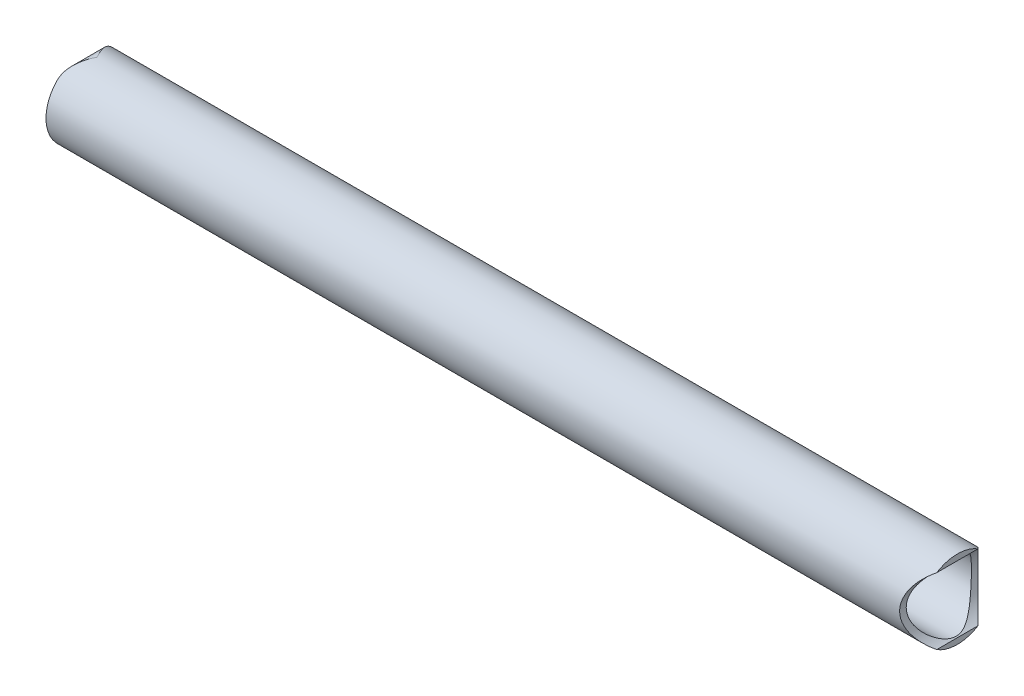
ISO-10303-21;
HEADER;
FILE_DESCRIPTION(('STEP AP214'),'2;1');
FILE_NAME('part.step','',(''),(''),'','','');
FILE_SCHEMA(('AUTOMOTIVE_DESIGN { 1 0 10303 214 1 1 1 1 }'));
ENDSEC;
DATA;
#1=APPLICATION_CONTEXT('core data for automotive mechanical design processes');
#2=APPLICATION_PROTOCOL_DEFINITION('international standard','automotive_design',2000,#1);
#3=PRODUCT_CONTEXT('',#1,'mechanical');
#4=PRODUCT('Part','Part','',(#3));
#5=PRODUCT_RELATED_PRODUCT_CATEGORY('part','',(#4));
#6=PRODUCT_DEFINITION_FORMATION('','',#4);
#7=PRODUCT_DEFINITION_CONTEXT('part definition',#1,'design');
#8=PRODUCT_DEFINITION('design','',#6,#7);
#9=PRODUCT_DEFINITION_SHAPE('','',#8);
#10=(LENGTH_UNIT() NAMED_UNIT(*) SI_UNIT(.MILLI.,.METRE.));
#11=(NAMED_UNIT(*) PLANE_ANGLE_UNIT() SI_UNIT($,.RADIAN.));
#12=(NAMED_UNIT(*) SI_UNIT($,.STERADIAN.) SOLID_ANGLE_UNIT());
#13=UNCERTAINTY_MEASURE_WITH_UNIT(LENGTH_MEASURE(1.E-05),#10,'distance_accuracy_value','');
#14=(GEOMETRIC_REPRESENTATION_CONTEXT(3) GLOBAL_UNCERTAINTY_ASSIGNED_CONTEXT((#13)) GLOBAL_UNIT_ASSIGNED_CONTEXT((#10,
#11,#12)) REPRESENTATION_CONTEXT('',''));
#15=CARTESIAN_POINT('',(0.,0.,0.));
#16=DIRECTION('',(0.,0.,1.));
#17=DIRECTION('',(1.,0.,0.));
#18=AXIS2_PLACEMENT_3D('',#15,#16,#17);
#19=CARTESIAN_POINT('',(469.10625,0.,0.));
#20=DIRECTION('',(1.,0.,0.));
#21=DIRECTION('',(0.,0.,-1.));
#22=AXIS2_PLACEMENT_3D('',#19,#20,#21);
#23=PLANE('',#22);
#24=DIRECTION('',(0.,0.,1.));
#25=VECTOR('',#24,1.);
#26=CARTESIAN_POINT('',(469.10625,17.9154421589309,-21.082));
#27=LINE('',#26,#25);
#28=CARTESIAN_POINT('',(469.10625,17.9154421589309,-11.1125));
#29=VERTEX_POINT('',#28);
#30=CARTESIAN_POINT('',(469.10625,17.915442158931,11.1125));
#31=VERTEX_POINT('',#30);
#32=EDGE_CURVE('E88',#29,#31,#27,.T.);
#33=ORIENTED_EDGE('',*,*,#32,.F.);
#34=CARTESIAN_POINT('',(469.10625,0.,0.));
#35=DIRECTION('',(1.,0.,0.));
#36=DIRECTION('',(0.,0.,-1.));
#37=AXIS2_PLACEMENT_3D('',#34,#35,#36);
#38=CIRCLE('',#37,21.082);
#39=EDGE_CURVE('E48',#29,#31,#38,.T.);
#40=ORIENTED_EDGE('',*,*,#39,.T.);
#41=EDGE_LOOP('',(#33,#40));
#42=FACE_BOUND('',#41,.T.);
#43=ADVANCED_FACE('F33',(#42),#23,.T.);
#44=DIRECTION('',(0.,0.,1.));
#45=VECTOR('',#44,1.);
#46=CARTESIAN_POINT('',(469.10625,-17.9154421589309,-21.082));
#47=LINE('',#46,#45);
#48=CARTESIAN_POINT('',(469.10625,-17.915442158931,11.1125));
#49=VERTEX_POINT('',#48);
#50=CARTESIAN_POINT('',(469.10625,-17.9154421589309,-11.1125));
#51=VERTEX_POINT('',#50);
#52=EDGE_CURVE('E85',#49,#51,#47,.F.);
#53=ORIENTED_EDGE('',*,*,#52,.F.);
#54=EDGE_CURVE('E93',#49,#51,#38,.T.);
#55=ORIENTED_EDGE('',*,*,#54,.T.);
#56=EDGE_LOOP('',(#53,#55));
#57=FACE_BOUND('',#56,.T.);
#58=ADVANCED_FACE('F92',(#57),#23,.T.);
#59=CARTESIAN_POINT('',(0.,0.,0.));
#60=DIRECTION('',(1.,0.,0.));
#61=DIRECTION('',(0.,0.,-1.));
#62=AXIS2_PLACEMENT_3D('',#59,#60,#61);
#63=PLANE('',#62);
#64=CARTESIAN_POINT('',(0.,0.,0.));
#65=DIRECTION('',(1.,0.,0.));
#66=DIRECTION('',(0.,0.,-1.));
#67=AXIS2_PLACEMENT_3D('',#64,#65,#66);
#68=CIRCLE('',#67,21.082);
#69=CARTESIAN_POINT('',(0.,14.732,15.0804144505382));
#70=VERTEX_POINT('',#69);
#71=CARTESIAN_POINT('',(0.,14.732,-15.0804144505382));
#72=VERTEX_POINT('',#71);
#73=EDGE_CURVE('E96',#70,#72,#68,.T.);
#74=ORIENTED_EDGE('',*,*,#73,.F.);
#75=DIRECTION('',(0.,0.,1.));
#76=VECTOR('',#75,1.);
#77=CARTESIAN_POINT('',(0.,14.732,-21.082));
#78=LINE('',#77,#76);
#79=CARTESIAN_POINT('',(0.,14.732,9.49362164824362));
#80=VERTEX_POINT('',#79);
#81=EDGE_CURVE('E126',#80,#70,#78,.T.);
#82=ORIENTED_EDGE('',*,*,#81,.F.);
#83=CARTESIAN_POINT('',(0.,0.,0.));
#84=DIRECTION('',(1.,0.,0.));
#85=DIRECTION('',(0.,0.,-1.));
#86=AXIS2_PLACEMENT_3D('',#83,#84,#85);
#87=CIRCLE('',#86,17.526);
#88=CARTESIAN_POINT('',(0.,14.732,-9.49362164824362));
#89=VERTEX_POINT('',#88);
#90=EDGE_CURVE('E99',#80,#89,#87,.T.);
#91=ORIENTED_EDGE('',*,*,#90,.T.);
#92=EDGE_CURVE('E62',#72,#89,#78,.T.);
#93=ORIENTED_EDGE('',*,*,#92,.F.);
#94=EDGE_LOOP('',(#74,#82,#91,#93));
#95=FACE_BOUND('',#94,.T.);
#96=ADVANCED_FACE('F139',(#95),#63,.F.);
#97=CARTESIAN_POINT('',(469.10625,0.,0.));
#98=DIRECTION('',(-1.,0.,0.));
#99=DIRECTION('',(0.,0.,1.));
#100=AXIS2_PLACEMENT_3D('',#97,#98,#99);
#101=CYLINDRICAL_SURFACE('',#100,21.082);
#102=ORIENTED_EDGE('',*,*,#73,.T.);
#103=CARTESIAN_POINT('',(0.,14.732,-15.0804144505382));
#104=CARTESIAN_POINT('',(4.99777097256306E-06,14.8585166363932,-14.9568250218965));
#105=CARTESIAN_POINT('',(0.0037804024379681,14.9834433145249,-14.8316684363902));
#106=CARTESIAN_POINT('',(0.018344612519162,15.2298802862784,-14.578499414352));
#107=CARTESIAN_POINT('',(0.0291313987626797,15.3513915529794,-14.4504878102679));
#108=CARTESIAN_POINT('',(0.0711641868780703,15.7100653220193,-14.0630095037458));
#109=CARTESIAN_POINT('',(0.112087001365868,15.9418874425845,-13.7995912481011));
#110=CARTESIAN_POINT('',(0.215488507432889,16.3879660671565,-13.2666880799684));
#111=CARTESIAN_POINT('',(0.277765297706076,16.6023646270495,-12.997281336883));
#112=CARTESIAN_POINT('',(0.420807437337394,17.0156387002352,-12.4513482602452));
#113=CARTESIAN_POINT('',(0.501584818248204,17.2145039983668,-12.1748173979638));
#114=CARTESIAN_POINT('',(0.722336490267377,17.6901137279932,-11.4788940830607));
#115=CARTESIAN_POINT('',(0.871915178025879,17.9572278098856,-11.0559422302578));
#116=CARTESIAN_POINT('',(1.19848542775072,18.4567086453977,-10.2003069203716));
#117=CARTESIAN_POINT('',(1.37548494857253,18.6890652721093,-9.76762066916));
#118=CARTESIAN_POINT('',(1.75209895067343,19.1211226362083,-8.89229878891464));
#119=CARTESIAN_POINT('',(1.9518397925665,19.3206241773796,-8.4496197349844));
#120=CARTESIAN_POINT('',(2.36824696498252,19.6862817768882,-7.55863388229215));
#121=CARTESIAN_POINT('',(2.58491234738668,19.8524397012882,-7.11032739995988));
#122=CARTESIAN_POINT('',(3.07854021979459,20.1841782782303,-6.11397748165988));
#123=CARTESIAN_POINT('',(3.35855407719812,20.3421826858222,-5.56492077807607));
#124=CARTESIAN_POINT('',(3.93195657278609,20.6121360645314,-4.46237555433802));
#125=CARTESIAN_POINT('',(4.2253492325938,20.7240710846151,-3.90888574337448));
#126=CARTESIAN_POINT('',(4.81966564824809,20.9026212412311,-2.80091191808466));
#127=CARTESIAN_POINT('',(5.12056407013035,20.9693718110366,-2.24643591433334));
#128=CARTESIAN_POINT('',(5.7263441140806,21.0587059818151,-1.13639917411688));
#129=CARTESIAN_POINT('',(6.0312234277849,21.0813141259917,-0.580839212441869));
#130=CARTESIAN_POINT('',(6.34068566822062,21.0819948744209,-0.0169715207830517));
#131=CARTESIAN_POINT('',(6.34534284661023,21.081999997751,-0.00848573804402203));
#132=CARTESIAN_POINT('',(6.35,21.082,0.));
#133=B_SPLINE_CURVE_WITH_KNOTS('',3,(#103,#104,#105,#106,#107,#108,#109,#110,#111,#112,#113,
#114,#115,#116,#117,#118,#119,#120,#121,#122,#123,#124,#125,#126,#127,#128,#129,#130,#131,#132),
.UNSPECIFIED.,.F.,.F.,(4,2,2,2,2,2,2,2,2,2,2,2,2,2,4),(0.,0.530465682198346,1.06077866603508,
2.11923257632368,3.16794284977036,4.21733708093636,5.78132496799527,7.34576765361523,
8.91937150261676,10.4928872609037,12.3996794344843,14.3070486112538,16.2086751300639,
18.1092440424708,18.1382833302831),.UNSPECIFIED.);
#134=CARTESIAN_POINT('',(6.35,21.082,0.));
#135=VERTEX_POINT('',#134);
#136=EDGE_CURVE('E125',#72,#135,#133,.T.);
#137=ORIENTED_EDGE('',*,*,#136,.T.);
#138=CARTESIAN_POINT('',(0.,14.732,15.0804144505382));
#139=CARTESIAN_POINT('',(4.99777097265902E-06,14.8585166363932,14.9568250218965));
#140=CARTESIAN_POINT('',(0.00378040243796859,14.983443314525,14.8316684363902));
#141=CARTESIAN_POINT('',(0.0183446125191639,15.2298802862785,14.5784994143519));
#142=CARTESIAN_POINT('',(0.0291313987626825,15.3513915529794,14.4504878102678));
#143=CARTESIAN_POINT('',(0.071164186878077,15.7100653220194,14.0630095037458));
#144=CARTESIAN_POINT('',(0.112087001365878,15.9418874425845,13.799591248101));
#145=CARTESIAN_POINT('',(0.215488507432905,16.3879660671565,13.2666880799683));
#146=CARTESIAN_POINT('',(0.277765297706091,16.6023646270495,12.9972813368829));
#147=CARTESIAN_POINT('',(0.420807437337405,17.0156387002352,12.4513482602451));
#148=CARTESIAN_POINT('',(0.501584818248212,17.2145039983668,12.1748173979638));
#149=CARTESIAN_POINT('',(0.722336490267378,17.6901137279932,11.4788940830607));
#150=CARTESIAN_POINT('',(0.871915178025876,17.9572278098856,11.0559422302578));
#151=CARTESIAN_POINT('',(1.19848542775071,18.4567086453976,10.2003069203717));
#152=CARTESIAN_POINT('',(1.37548494857251,18.6890652721093,9.76762066916005));
#153=CARTESIAN_POINT('',(1.75209895067341,19.1211226362082,8.89229878891469));
#154=CARTESIAN_POINT('',(1.95183979256649,19.3206241773795,8.44961973498444));
#155=CARTESIAN_POINT('',(2.36824696498251,19.6862817768881,7.55863388229216));
#156=CARTESIAN_POINT('',(2.58491234738667,19.8524397012882,7.11032739995988));
#157=CARTESIAN_POINT('',(3.0785402197946,20.1841782782303,6.11397748165988));
#158=CARTESIAN_POINT('',(3.35855407719814,20.3421826858222,5.56492077807609));
#159=CARTESIAN_POINT('',(3.93195657278606,20.6121360645314,4.462375554338));
#160=CARTESIAN_POINT('',(4.22534923259369,20.7240710846151,3.90888574337441));
#161=CARTESIAN_POINT('',(4.81966564824822,20.9026212412311,2.80091191808473));
#162=CARTESIAN_POINT('',(5.12056407013078,20.9693718110366,2.24643591433359));
#163=CARTESIAN_POINT('',(5.72634411408013,21.0587059818151,1.13639917411665));
#164=CARTESIAN_POINT('',(6.03122342778322,21.0813141259917,0.580839212440988));
#165=CARTESIAN_POINT('',(6.34068566822056,21.0819948744209,0.0169715207830728));
#166=CARTESIAN_POINT('',(6.3453428466102,21.081999997751,0.00848573804405541));
#167=CARTESIAN_POINT('',(6.35,21.082,0.));
#168=B_SPLINE_CURVE_WITH_KNOTS('',3,(#138,#139,#140,#141,#142,#143,#144,#145,#146,#147,#148,
#149,#150,#151,#152,#153,#154,#155,#156,#157,#158,#159,#160,#161,#162,#163,#164,#165,#166,#167),
.UNSPECIFIED.,.F.,.F.,(4,2,2,2,2,2,2,2,2,2,2,2,2,2,4),(0.,0.530465682198373,1.06077866603513,
2.11923257632378,3.16794284977042,4.21733708093637,5.78132496799524,7.34576765361516,
8.91937150261673,10.4928872609037,12.3996794344843,14.3070486112539,16.2086751300639,
18.1092440424708,18.1382833302831),.UNSPECIFIED.);
#169=EDGE_CURVE('E118',#135,#70,#168,.F.);
#170=ORIENTED_EDGE('',*,*,#169,.T.);
#171=EDGE_LOOP('',(#102,#137,#170));
#172=FACE_BOUND('',#171,.T.);
#173=ORIENTED_EDGE('',*,*,#39,.F.);
#174=CARTESIAN_POINT('',(480.21875,0.,0.));
#175=DIRECTION('',(-0.707106781186548,0.,0.707106781186547));
#176=DIRECTION('',(-0.707106781186548,0.,-0.707106781186547));
#177=AXIS2_PLACEMENT_3D('',#174,#175,#176);
#178=ELLIPSE('',#177,29.8144503219496,21.082);
#179=EDGE_CURVE('E95',#29,#51,#178,.T.);
#180=ORIENTED_EDGE('',*,*,#179,.T.);
#181=ORIENTED_EDGE('',*,*,#54,.F.);
#182=CARTESIAN_POINT('',(480.21875,0.,0.));
#183=DIRECTION('',(-0.707106781186548,0.,-0.707106781186547));
#184=DIRECTION('',(-0.707106781186548,0.,0.707106781186547));
#185=AXIS2_PLACEMENT_3D('',#182,#183,#184);
#186=ELLIPSE('',#185,29.8144503219496,21.082);
#187=EDGE_CURVE('E55',#49,#31,#186,.T.);
#188=ORIENTED_EDGE('',*,*,#187,.T.);
#189=EDGE_LOOP('',(#173,#180,#181,#188));
#190=FACE_BOUND('',#189,.T.);
#191=ADVANCED_FACE('F35',(#172,#190),#101,.T.);
#192=CARTESIAN_POINT('',(469.10625,0.,0.));
#193=DIRECTION('',(-1.,0.,0.));
#194=DIRECTION('',(0.,0.,1.));
#195=AXIS2_PLACEMENT_3D('',#192,#193,#194);
#196=CYLINDRICAL_SURFACE('',#195,17.526);
#197=CARTESIAN_POINT('',(459.13675,0.,17.526));
#198=CARTESIAN_POINT('',(459.136753100232,0.416555730228906,17.525996813955));
#199=CARTESIAN_POINT('',(459.149123313981,0.833163012071545,17.5111221446535));
#200=CARTESIAN_POINT('',(459.198320724751,1.66285085098589,17.4518957288154));
#201=CARTESIAN_POINT('',(459.235152005793,2.0759308074684,17.4075390599622));
#202=CARTESIAN_POINT('',(459.332452439066,2.89546158233793,17.2901260170745));
#203=CARTESIAN_POINT('',(459.392938843433,3.30190733638105,17.2170486963236));
#204=CARTESIAN_POINT('',(459.536212942405,4.10484124386305,17.0434647188049));
#205=CARTESIAN_POINT('',(459.619000210819,4.50132958743919,16.9429585862272));
#206=CARTESIAN_POINT('',(459.804608337995,5.27944797465432,16.7167963170662));
#207=CARTESIAN_POINT('',(459.907303655403,5.66115402240748,16.5912976561353));
#208=CARTESIAN_POINT('',(460.13114125938,6.41026860382347,16.3165047587702));
#209=CARTESIAN_POINT('',(460.252283245215,6.77767737045173,16.1672109102661));
#210=CARTESIAN_POINT('',(460.510997114563,7.49674702968466,15.8465909890381));
#211=CARTESIAN_POINT('',(460.648570010029,7.84840695050787,15.6752635592522));
#212=CARTESIAN_POINT('',(460.938082247339,8.53495429518089,15.3122852034019));
#213=CARTESIAN_POINT('',(461.090024633481,8.86983814178559,15.1206299696701));
#214=CARTESIAN_POINT('',(461.464140089599,9.64160099861961,14.6449374869007));
#215=CARTESIAN_POINT('',(461.691652769384,10.0709113512938,14.3527749107548));
#216=CARTESIAN_POINT('',(462.164488465582,10.8958978241818,13.7370028939555));
#217=CARTESIAN_POINT('',(462.409817485787,11.2915625079794,13.4133828401386));
#218=CARTESIAN_POINT('',(462.913798875036,12.049775776248,12.7366579401323));
#219=CARTESIAN_POINT('',(463.17248335067,12.4122381349312,12.3834806406871));
#220=CARTESIAN_POINT('',(463.697391944567,13.102805813699,11.6503545982694));
#221=CARTESIAN_POINT('',(463.963615114459,13.4309154311957,11.2704092138659));
#222=CARTESIAN_POINT('',(464.503016862729,14.0584742968281,10.4776077506457));
#223=CARTESIAN_POINT('',(464.776233749344,14.3572918160694,10.0642778803075));
#224=CARTESIAN_POINT('',(465.318313078632,14.9191165849368,9.21095532717234));
#225=CARTESIAN_POINT('',(465.587174038226,15.1821118547605,8.77095379548327));
#226=CARTESIAN_POINT('',(466.111691041438,15.6706637077535,7.86481925902692));
#227=CARTESIAN_POINT('',(466.367377460908,15.8963093356672,7.39875205622169));
#228=CARTESIAN_POINT('',(466.855669817722,16.3089147666568,6.43838077354218));
#229=CARTESIAN_POINT('',(467.088295378546,16.4959076106971,5.94410127510899));
#230=CARTESIAN_POINT('',(467.419892415188,16.7529770224336,5.15602712210236));
#231=CARTESIAN_POINT('',(467.531806838252,16.837735543251,4.872411200417));
#232=CARTESIAN_POINT('',(467.741705453925,16.9938564773723,4.29634473218566));
#233=CARTESIAN_POINT('',(467.83968784338,17.0652171570416,4.00389304799845));
#234=CARTESIAN_POINT('',(468.018453347219,17.1934754104678,3.41127303424146));
#235=CARTESIAN_POINT('',(468.099269928926,17.2504011700851,3.11112102298287));
#236=CARTESIAN_POINT('',(468.240783138788,17.3489622258268,2.503748224318));
#237=CARTESIAN_POINT('',(468.301490351692,17.3906055672393,2.19653124698383));
#238=CARTESIAN_POINT('',(468.400642338332,17.4581424184477,1.57275012439623));
#239=CARTESIAN_POINT('',(468.438798088988,17.4838316609619,1.25611705495765));
#240=CARTESIAN_POINT('',(468.489564384314,17.517930419636,0.619877416859227));
#241=CARTESIAN_POINT('',(468.502177230519,17.526341492641,0.300271118708478));
#242=CARTESIAN_POINT('',(468.501123738161,17.5256372212721,-0.338900631657943));
#243=CARTESIAN_POINT('',(468.487455708289,17.5165207489109,-0.658466079921118));
#244=CARTESIAN_POINT('',(468.434638550502,17.4810304342677,-1.29450990358539));
#245=CARTESIAN_POINT('',(468.395486264212,17.454654452937,-1.61098789140883));
#246=CARTESIAN_POINT('',(468.289324257895,17.3822895125155,-2.26597180787558));
#247=CARTESIAN_POINT('',(468.220160695607,17.3347748801548,-2.6039563959663));
#248=CARTESIAN_POINT('',(468.05798050578,17.2213863424108,-3.27094152568147));
#249=CARTESIAN_POINT('',(467.964960013026,17.1555094618906,-3.59994060193884));
#250=CARTESIAN_POINT('',(467.758998964524,17.0065131076897,-4.24855727345));
#251=CARTESIAN_POINT('',(467.64600613574,16.9233482836622,-4.56814761827544));
#252=CARTESIAN_POINT('',(467.404253660727,16.7410384013215,-5.19667563423267));
#253=CARTESIAN_POINT('',(467.275487866865,16.6418871073676,-5.50560909125264));
#254=CARTESIAN_POINT('',(466.927147015409,16.3663636741079,-6.28987340285503));
#255=CARTESIAN_POINT('',(466.698405644521,16.1786783054546,-6.75718011774374));
#256=CARTESIAN_POINT('',(466.221976191773,15.7683263145676,-7.66612047395263));
#257=CARTESIAN_POINT('',(465.974277188512,15.5456394491178,-8.10773905469757));
#258=CARTESIAN_POINT('',(465.468372952079,15.0664754392744,-8.96683638051191));
#259=CARTESIAN_POINT('',(465.21015403316,14.8099532398125,-9.38428185098054));
#260=CARTESIAN_POINT('',(464.690466965766,14.2641231324516,-10.1948087082538));
#261=CARTESIAN_POINT('',(464.428999471574,13.9748217341554,-10.5878949086503));
#262=CARTESIAN_POINT('',(463.895324879337,13.348195218157,-11.368790869149));
#263=CARTESIAN_POINT('',(463.623240901127,13.0091843032674,-11.7553355433847));
#264=CARTESIAN_POINT('',(463.087541373633,12.2951909614096,-12.5002060187878));
#265=CARTESIAN_POINT('',(462.823927094039,11.9202031744408,-12.8585276006225));
#266=CARTESIAN_POINT('',(462.311174827839,11.1350258886843,-13.5441070863272));
#267=CARTESIAN_POINT('',(462.062010084927,10.7249051788906,-13.8714231651622));
#268=CARTESIAN_POINT('',(461.7029705029,10.0834868401277,-14.3371461507588));
#269=CARTESIAN_POINT('',(461.585752726259,9.8653306424743,-14.4881649831134));
#270=CARTESIAN_POINT('',(461.356837871324,9.42027707168284,-14.7814103315513));
#271=CARTESIAN_POINT('',(461.245142151037,9.19337757252926,-14.9236346869964));
#272=CARTESIAN_POINT('',(460.973493112914,8.61498224084044,-15.2678084182525));
#273=CARTESIAN_POINT('',(460.817459068209,8.25811349099297,-15.4639027842676));
#274=CARTESIAN_POINT('',(460.521964191443,7.52616004996061,-15.8330525436508));
#275=CARTESIAN_POINT('',(460.382499423159,7.15107971509298,-16.0061134100713));
#276=CARTESIAN_POINT('',(460.122537175912,6.38410638575886,-16.3271734823368));
#277=CARTESIAN_POINT('',(460.00203301395,5.99221937735624,-16.4751815198914));
#278=CARTESIAN_POINT('',(459.782250109816,5.19343454244432,-16.7441479493523));
#279=CARTESIAN_POINT('',(459.682971726726,4.78653646212599,-16.8651058836479));
#280=CARTESIAN_POINT('',(459.507089403541,3.95712937963007,-17.0788335101842));
#281=CARTESIAN_POINT('',(459.430663185674,3.53452536865489,-17.1713824047497));
#282=CARTESIAN_POINT('',(459.30330895774,2.67986601870688,-17.325342710614));
#283=CARTESIAN_POINT('',(459.252380994275,2.24781066246181,-17.3867540650041));
#284=CARTESIAN_POINT('',(459.177324216148,1.37821649825806,-17.4771905064637));
#285=CARTESIAN_POINT('',(459.153182158585,0.940680508218323,-17.5062315973617));
#286=CARTESIAN_POINT('',(459.132290012414,0.0640313485043037,-17.5313661812511));
#287=CARTESIAN_POINT('',(459.135537074792,-0.37508165237985,-17.5274631010918));
#288=CARTESIAN_POINT('',(459.167335633984,-1.19930498558239,-17.4891990815668));
#289=CARTESIAN_POINT('',(459.192874675364,-1.58470875998572,-17.4584640327402));
#290=CARTESIAN_POINT('',(459.264684232639,-2.35069997583225,-17.3719144045829));
#291=CARTESIAN_POINT('',(459.310952802018,-2.73128786604044,-17.3161021800126));
#292=CARTESIAN_POINT('',(459.42332254399,-3.48513791526224,-17.1802563891461));
#293=CARTESIAN_POINT('',(459.489424907109,-3.85839963308743,-17.1002213688688));
#294=CARTESIAN_POINT('',(459.64024630486,-4.59536738648546,-16.9170761014037));
#295=CARTESIAN_POINT('',(459.724966273857,-4.95907294143571,-16.813964696073));
#296=CARTESIAN_POINT('',(459.913145504431,-5.68108005964255,-16.5840874699882));
#297=CARTESIAN_POINT('',(460.016895992016,-6.03918783157445,-16.4569529541794));
#298=CARTESIAN_POINT('',(460.240467917882,-6.74203119401674,-16.1817226350541));
#299=CARTESIAN_POINT('',(460.360289050715,-7.08676703852215,-16.033627230131));
#300=CARTESIAN_POINT('',(460.614268706947,-7.7617711253795,-15.7179651464271));
#301=CARTESIAN_POINT('',(460.748429245294,-8.09203732526567,-15.5503957309038));
#302=CARTESIAN_POINT('',(461.029307650088,-8.73727082208682,-15.1972398091077));
#303=CARTESIAN_POINT('',(461.176028031205,-9.05223503545283,-15.0116496938153));
#304=CARTESIAN_POINT('',(461.548812920572,-9.80464712063615,-14.5364034891831));
#305=CARTESIAN_POINT('',(461.780846995919,-10.2333578451482,-14.2375288779349));
#306=CARTESIAN_POINT('',(462.262358234905,-11.0565036944503,-13.6081978996813));
#307=CARTESIAN_POINT('',(462.511842112484,-11.4509254939542,-13.2777293585403));
#308=CARTESIAN_POINT('',(463.023748955069,-12.2062013475731,-12.5869774042746));
#309=CARTESIAN_POINT('',(463.286207884647,-12.5669530526875,-12.2266089972621));
#310=CARTESIAN_POINT('',(463.817996141297,-13.253470559835,-11.4788424530418));
#311=CARTESIAN_POINT('',(464.08732447637,-13.5792413783913,-11.091448204724));
#312=CARTESIAN_POINT('',(464.631962798302,-14.2012900820747,-10.2834169092844));
#313=CARTESIAN_POINT('',(464.907294003942,-14.4969406813881,-9.8623113113111));
#314=CARTESIAN_POINT('',(465.452322074852,-15.0517275612925,-8.99289776114401));
#315=CARTESIAN_POINT('',(465.722016777624,-15.3108500388738,-8.54457961710635));
#316=CARTESIAN_POINT('',(466.246222682617,-15.7906628138659,-7.62139093429989));
#317=CARTESIAN_POINT('',(466.500775922646,-16.0114631279653,-7.14660175430663));
#318=CARTESIAN_POINT('',(466.984149383237,-16.4132437140876,-6.16809279152978));
#319=CARTESIAN_POINT('',(467.212994501134,-16.5942626782093,-5.6644017261431));
#320=CARTESIAN_POINT('',(467.533166365567,-16.8388425611419,-4.86810478458098));
#321=CARTESIAN_POINT('',(467.63901918611,-16.9179225696371,-4.58604260557915));
#322=CARTESIAN_POINT('',(467.836250596365,-17.062806654192,-4.01353560636163));
#323=CARTESIAN_POINT('',(467.92763123726,-17.1286126119829,-3.72309198098292));
#324=CARTESIAN_POINT('',(468.092782938295,-17.2459247048064,-3.13503376582409));
#325=CARTESIAN_POINT('',(468.166590343537,-17.2974603903694,-2.83743540296246));
#326=CARTESIAN_POINT('',(468.29389080646,-17.3854671554674,-2.23575303013736));
#327=CARTESIAN_POINT('',(468.347389138256,-17.4219421463683,-1.93167072569972));
#328=CARTESIAN_POINT('',(468.432050986908,-17.4793343349965,-1.31542257105261));
#329=CARTESIAN_POINT('',(468.462959056324,-17.5000736934338,-1.00320440672016));
#330=CARTESIAN_POINT('',(468.499785417953,-17.524756770186,-0.376634351053846));
#331=CARTESIAN_POINT('',(468.505705534394,-17.5287017145648,-0.0622826171578791));
#332=CARTESIAN_POINT('',(468.492219236601,-17.519682115217,0.565765427557123));
#333=CARTESIAN_POINT('',(468.472801625762,-17.5067100959756,0.87946138722474));
#334=CARTESIAN_POINT('',(468.409708218613,-17.4642111799082,1.50326166249684));
#335=CARTESIAN_POINT('',(468.366029014212,-17.4346819572413,1.8133654672525));
#336=CARTESIAN_POINT('',(468.24947913328,-17.3549094765865,2.46783373112703));
#337=CARTESIAN_POINT('',(468.173539424602,-17.302463431889,2.81137909094881));
#338=CARTESIAN_POINT('',(467.99769360765,-17.1787080018257,3.48874159064592));
#339=CARTESIAN_POINT('',(467.897782550923,-17.1073947213456,3.82255670590954));
#340=CARTESIAN_POINT('',(467.678186596836,-16.947078987979,4.48018532937914));
#341=CARTESIAN_POINT('',(467.55845074705,-16.8580308311813,4.80397044519033));
#342=CARTESIAN_POINT('',(467.303531095877,-16.6635408359202,5.44039078400235));
#343=CARTESIAN_POINT('',(467.168341323107,-16.5580926547885,5.75302163536546));
#344=CARTESIAN_POINT('',(466.803678142386,-16.2655608949425,6.54686642927639));
#345=CARTESIAN_POINT('',(466.565311783285,-16.0668060807317,7.0197186237903));
#346=CARTESIAN_POINT('',(466.070778251224,-15.6331071713109,7.93883090279246));
#347=CARTESIAN_POINT('',(465.814601013657,-15.3981425218364,8.38507568297595));
#348=CARTESIAN_POINT('',(465.292991177891,-14.8931005076266,9.25247800104897));
#349=CARTESIAN_POINT('',(465.027546784682,-14.6229771058186,9.67360157184695));
#350=CARTESIAN_POINT('',(464.49479644847,-14.0485414814654,10.4903942108924));
#351=CARTESIAN_POINT('',(464.227490886297,-13.7442360709218,10.8860683262347));
#352=CARTESIAN_POINT('',(463.685008627962,-13.0872302237909,11.6686564771624));
#353=CARTESIAN_POINT('',(463.410011314537,-12.7329783860628,12.0543962817461));
#354=CARTESIAN_POINT('',(462.870324829164,-11.9872775461265,12.7961902436962));
#355=CARTESIAN_POINT('',(462.60563734665,-11.5958224834142,13.1522395466039));
#356=CARTESIAN_POINT('',(462.092856716602,-10.776623787392,13.8313916713883));
#357=CARTESIAN_POINT('',(461.844731277596,-10.3489546907981,14.1545592898452));
#358=CARTESIAN_POINT('',(461.489058671317,-9.6805538418048,14.6123392874479));
#359=CARTESIAN_POINT('',(461.373266967441,-9.45330032462178,14.7604208100894));
#360=CARTESIAN_POINT('',(461.147843154438,-8.98986303225831,15.0471693205303));
#361=CARTESIAN_POINT('',(461.03821252428,-8.7536771354263,15.1858340494738));
#362=CARTESIAN_POINT('',(460.777882456114,-8.16388969440334,15.5135810654738));
#363=CARTESIAN_POINT('',(460.631019615212,-7.80547285234025,15.6971201066552));
#364=CARTESIAN_POINT('',(460.354258282389,-7.07152507053722,16.0411475968501));
#365=CARTESIAN_POINT('',(460.224355748624,-6.69599823719479,16.2016415386992));
#366=CARTESIAN_POINT('',(459.983865788701,-5.92969186792639,16.4975121757086));
#367=CARTESIAN_POINT('',(459.873255954141,-5.53893068115682,16.6329180221441));
#368=CARTESIAN_POINT('',(459.673317296928,-4.74382214338575,16.8768969338328));
#369=CARTESIAN_POINT('',(459.583984673672,-4.33947723349805,16.9854747913174));
#370=CARTESIAN_POINT('',(459.445844180231,-3.61139042732534,17.1529959877094));
#371=CARTESIAN_POINT('',(459.392441530083,-3.2898093654496,17.2176086822695));
#372=CARTESIAN_POINT('',(459.300313709527,-2.64139463379433,17.3289327236608));
#373=CARTESIAN_POINT('',(459.261591366206,-2.31455996491102,17.3756406224611));
#374=CARTESIAN_POINT('',(459.199400717763,-1.657300955975,17.4505998410856));
#375=CARTESIAN_POINT('',(459.175933854947,-1.32687627951213,17.4788494157967));
#376=CARTESIAN_POINT('',(459.144609151471,-0.66431170552806,17.5165484873698));
#377=CARTESIAN_POINT('',(459.136747527795,-0.332172243283639,17.5260025406341));
#378=CARTESIAN_POINT('',(459.13675,0.,17.526));
#379=B_SPLINE_CURVE_WITH_KNOTS('',3,(#197,#198,#199,#200,#201,#202,#203,#204,#205,#206,#207,
#208,#209,#210,#211,#212,#213,#214,#215,#216,#217,#218,#219,#220,#221,#222,#223,#224,#225,#226,
#227,#228,#229,#230,#231,#232,#233,#234,#235,#236,#237,#238,#239,#240,#241,#242,#243,#244,#245,
#246,#247,#248,#249,#250,#251,#252,#253,#254,#255,#256,#257,#258,#259,#260,#261,#262,#263,#264,
#265,#266,#267,#268,#269,#270,#271,#272,#273,#274,#275,#276,#277,#278,#279,#280,#281,#282,#283,
#284,#285,#286,#287,#288,#289,#290,#291,#292,#293,#294,#295,#296,#297,#298,#299,#300,#301,#302,
#303,#304,#305,#306,#307,#308,#309,#310,#311,#312,#313,#314,#315,#316,#317,#318,#319,#320,#321,
#322,#323,#324,#325,#326,#327,#328,#329,#330,#331,#332,#333,#334,#335,#336,#337,#338,#339,#340,
#341,#342,#343,#344,#345,#346,#347,#348,#349,#350,#351,#352,#353,#354,#355,#356,#357,#358,#359,
#360,#361,#362,#363,#364,#365,#366,#367,#368,#369,#370,#371,#372,#373,#374,#375,#376,#377,#378),
.UNSPECIFIED.,.T.,.F.,(4,2,2,2,2,2,2,2,2,2,2,2,2,2,2,2,2,2,2,2,2,2,2,2,2,2,2,2,2,2,2,2,2,2,2,2,
2,2,2,2,2,2,2,2,2,2,2,2,2,2,2,2,2,2,2,2,2,2,2,2,2,2,2,2,2,2,2,2,2,2,2,2,2,2,2,2,2,2,2,2,2,2,2,2,
2,2,2,2,2,2,4),(0.,1.24931215514068,2.49883294793602,3.74926674484587,4.99967664647633,
6.24244384055415,7.48519077601582,8.72801428973392,9.97110169852848,11.6694991969452,
13.3684717049052,15.0717382323203,16.7747914316099,18.508900041403,20.2435871614538,
21.974077138334,23.7030816933734,24.6518793950268,25.6007997833557,26.5478527733324,
27.4944064783684,28.4528421356183,29.4111914294722,30.3696024000782,31.3281321733839,
32.3712679495731,33.4145728378166,34.4606499010713,35.5071359859366,37.1638893836605,
38.8216045193316,40.4815497807695,42.1411659704712,43.8844508919193,45.6279959405214,
47.3682019789461,48.238133531576,49.1082779678088,50.4151915777868,51.7217940919451,
53.0279350344375,54.3340980714494,55.6501696985348,56.9662437309291,58.2816668085292,
59.5969530576398,60.7579780281908,61.9188940006416,63.0798796712698,64.240923621771,
65.4214962902465,66.6020465231705,67.7827628635306,68.9637161565106,70.6766447530631,
72.3902360758568,74.1088773225334,75.8272717729951,77.5762157648221,79.3258188748362,
81.0703129492533,82.8131027115062,83.7469352207905,84.6806352566832,85.6123870984828,
86.5438968054863,87.4857834704328,88.4276013724583,89.3698355997799,90.3122022187916,
91.3777285366849,92.4434750028669,93.5120043575646,94.5809479956882,96.2751844313667,
97.9703861554526,99.6678303471317,101.364936859805,103.137598327809,104.910549063673,
106.679935458133,107.564410898222,108.449097758104,109.733689326203,111.01797419982,
112.300757301213,113.58331109564,114.579500372221,115.575881394522,116.57235660447,
117.568590219854),.UNSPECIFIED.);
#380=CARTESIAN_POINT('',(459.13675,0.,17.526));
#381=VERTEX_POINT('',#380);
#382=EDGE_CURVE('E38',#381,#381,#379,.T.);
#383=ORIENTED_EDGE('',*,*,#382,.F.);
#384=EDGE_LOOP('',(#383));
#385=FACE_BOUND('',#384,.T.);
#386=CARTESIAN_POINT('',(0.,14.732,-9.49362164824361));
#387=CARTESIAN_POINT('',(1.18215827092096E-05,14.8512065552147,-9.30864758850528));
#388=CARTESIAN_POINT('',(0.00335629290756961,14.966903733683,-9.12145207419103));
#389=CARTESIAN_POINT('',(0.015618373053566,15.191067778283,-8.74302268186063));
#390=CARTESIAN_POINT('',(0.024534469369689,15.2995365978256,-8.55178991342886));
#391=CARTESIAN_POINT('',(0.0468365894807759,15.5089823218411,-8.16580160022169));
#392=CARTESIAN_POINT('',(0.0602176995159619,15.6099673136364,-7.97105014964136));
#393=CARTESIAN_POINT('',(0.0904463086584942,15.8044598611726,-7.57811282719616));
#394=CARTESIAN_POINT('',(0.107294062917175,15.8979668658161,-7.3799267035169));
#395=CARTESIAN_POINT('',(0.161710749515973,16.1677428894095,-6.77922295697602));
#396=CARTESIAN_POINT('',(0.203066270989696,16.3325710230985,-6.37184299640371));
#397=CARTESIAN_POINT('',(0.28865530712156,16.6311343918077,-5.5460775193833));
#398=CARTESIAN_POINT('',(0.332889819449679,16.7648587740876,-5.12768821805969));
#399=CARTESIAN_POINT('',(0.420233364203613,17.0075279308424,-4.25683335736751));
#400=CARTESIAN_POINT('',(0.463124929061231,17.1145638855675,-3.80380674958994));
#401=CARTESIAN_POINT('',(0.519476718498732,17.2479052083383,-3.11843895481312));
#402=CARTESIAN_POINT('',(0.536930761583319,17.2878189125596,-2.88899376313145));
#403=CARTESIAN_POINT('',(0.568518618471742,17.3584967782642,-2.42847866805183));
#404=CARTESIAN_POINT('',(0.582652788803805,17.3892619223255,-2.19740894186361));
#405=CARTESIAN_POINT('',(0.60700831203503,17.4414967310561,-1.73463327297525));
#406=CARTESIAN_POINT('',(0.617239840917754,17.4629905896764,-1.50293059363321));
#407=CARTESIAN_POINT('',(0.633438941414769,17.4967389939057,-1.03872466306625));
#408=CARTESIAN_POINT('',(0.639406934130212,17.5089944519799,-0.806221493184098));
#409=CARTESIAN_POINT('',(0.646841906691908,17.5242321079992,-0.340835958369956));
#410=CARTESIAN_POINT('',(0.648308834845186,17.5272141994432,-0.107953589113738));
#411=CARTESIAN_POINT('',(0.646683444701061,17.5238958672413,0.357727673351307));
#412=CARTESIAN_POINT('',(0.64359113409545,17.5175954592557,0.590526566700303));
#413=CARTESIAN_POINT('',(0.633015011982841,17.4958254842557,1.05357258230511));
#414=CARTESIAN_POINT('',(0.625569519654457,17.4804359133699,1.28382432502859));
#415=CARTESIAN_POINT('',(0.606616305295421,17.4405997328694,1.74338121783046));
#416=CARTESIAN_POINT('',(0.595108185917324,17.416152237328,1.97268627309738));
#417=CARTESIAN_POINT('',(0.555116369049375,17.3293085585805,2.65858155894497));
#418=CARTESIAN_POINT('',(0.521163416818214,17.2534079290171,3.11322070575031));
#419=CARTESIAN_POINT('',(0.443683996229778,17.0661243267718,4.01506176899039));
#420=CARTESIAN_POINT('',(0.400139881988926,16.9546757811965,4.4622483212256));
#421=CARTESIAN_POINT('',(0.31015365623528,16.6970370744889,5.34616265629826));
#422=CARTESIAN_POINT('',(0.263712022198695,16.5508526263209,5.78289214600579));
#423=CARTESIAN_POINT('',(0.190296116221632,16.2789916862365,6.49992819615105));
#424=CARTESIAN_POINT('',(0.162003200675152,16.1627907207943,6.78372963515089));
#425=CARTESIAN_POINT('',(0.109990072823221,15.9155254057193,7.34511810644267));
#426=CARTESIAN_POINT('',(0.0862682339282398,15.7844663697057,7.62270731812361));
#427=CARTESIAN_POINT('',(0.0460592939801918,15.5080873202831,8.17029076843601));
#428=CARTESIAN_POINT('',(0.0295522145321793,15.3628080690132,8.44030401764001));
#429=CARTESIAN_POINT('',(0.00654051357353983,15.0579847067746,8.9728539714487));
#430=CARTESIAN_POINT('',(4.36685221627461E-05,14.898429607302,9.23538470802819));
#431=CARTESIAN_POINT('',(0.,14.732,9.49362164824361));
#432=B_SPLINE_CURVE_WITH_KNOTS('',3,(#386,#387,#388,#389,#390,#391,#392,#393,#394,#395,#396,
#397,#398,#399,#400,#401,#402,#403,#404,#405,#406,#407,#408,#409,#410,#411,#412,#413,#414,#415,
#416,#417,#418,#419,#420,#421,#422,#423,#424,#425,#426,#427,#428,#429,#430,#431),.UNSPECIFIED.,
.F.,.F.,(4,2,2,2,2,2,2,2,2,2,2,2,2,2,2,2,2,2,2,2,2,2,4),(0.,0.660061225427474,1.31994334467436,
1.97910164384406,2.6383084756313,3.96109639181251,5.2843451659066,6.68505552254074,
7.38551890925716,8.08590703728532,8.78445623939876,9.48293643762741,10.1814246575994,
10.8799116991686,11.5723409064333,12.2648378558842,13.6496257450175,15.0369829791431,
16.4241121943468,17.3476269451524,18.2708124595747,19.1914251291658,20.1127526175606),.UNSPECIFIED.);
#433=EDGE_CURVE('E11',#89,#80,#432,.T.);
#434=ORIENTED_EDGE('',*,*,#433,.F.);
#435=ORIENTED_EDGE('',*,*,#90,.F.);
#436=EDGE_LOOP('',(#434,#435));
#437=FACE_BOUND('',#436,.T.);
#438=ADVANCED_FACE('F108',(#385,#437),#196,.F.);
#439=CARTESIAN_POINT('',(6.35,14.732,-21.082));
#440=DIRECTION('',(0.,0.,1.));
#441=DIRECTION('',(1.,0.,0.));
#442=AXIS2_PLACEMENT_3D('',#439,#440,#441);
#443=CYLINDRICAL_SURFACE('',#442,6.35);
#444=ORIENTED_EDGE('',*,*,#92,.T.);
#445=ORIENTED_EDGE('',*,*,#433,.T.);
#446=ORIENTED_EDGE('',*,*,#81,.T.);
#447=ORIENTED_EDGE('',*,*,#169,.F.);
#448=ORIENTED_EDGE('',*,*,#136,.F.);
#449=EDGE_LOOP('',(#444,#445,#446,#447,#448));
#450=FACE_BOUND('',#449,.T.);
#451=ADVANCED_FACE('F111',(#450),#443,.T.);
#452=CARTESIAN_POINT('',(480.21875,0.,-21.082));
#453=DIRECTION('',(0.,0.,1.));
#454=DIRECTION('',(1.,0.,0.));
#455=AXIS2_PLACEMENT_3D('',#452,#453,#454);
#456=CYLINDRICAL_SURFACE('',#455,21.082);
#457=ORIENTED_EDGE('',*,*,#382,.T.);
#458=EDGE_LOOP('',(#457));
#459=FACE_BOUND('',#458,.T.);
#460=ORIENTED_EDGE('',*,*,#32,.T.);
#461=ORIENTED_EDGE('',*,*,#187,.F.);
#462=ORIENTED_EDGE('',*,*,#52,.T.);
#463=ORIENTED_EDGE('',*,*,#179,.F.);
#464=EDGE_LOOP('',(#460,#461,#462,#463));
#465=FACE_BOUND('',#464,.T.);
#466=ADVANCED_FACE('F84',(#459,#465),#456,.F.);
#467=CLOSED_SHELL('',(#43,#58,#96,#191,#438,#451,#466));
#468=MANIFOLD_SOLID_BREP('B2',#467);
#469=ADVANCED_BREP_SHAPE_REPRESENTATION('',(#18,#468),#14);
#470=SHAPE_DEFINITION_REPRESENTATION(#9,#469);
ENDSEC;
END-ISO-10303-21;
